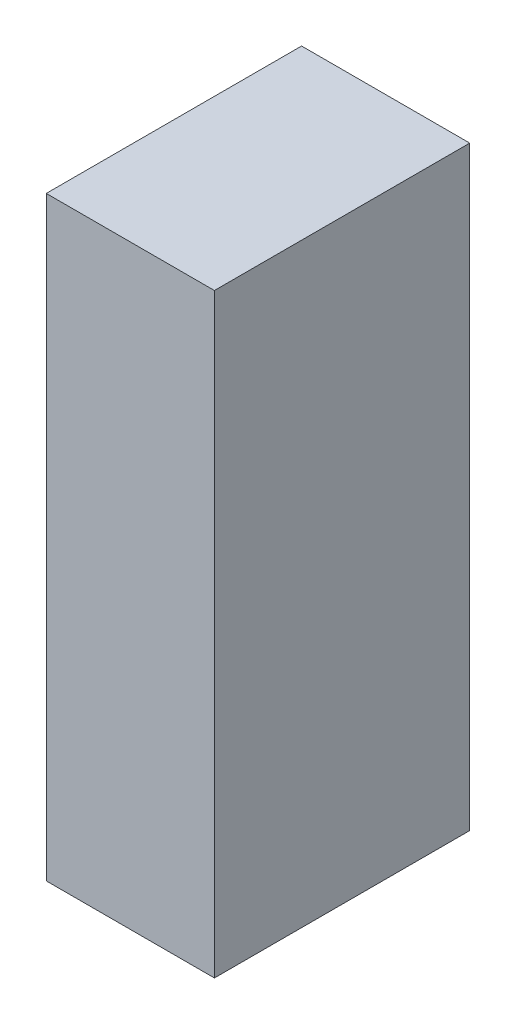
ISO-10303-21;
HEADER;
FILE_DESCRIPTION(('STEP AP214'),'2;1');
FILE_NAME('part.step','',(''),(''),'','','');
FILE_SCHEMA(('AUTOMOTIVE_DESIGN { 1 0 10303 214 1 1 1 1 }'));
ENDSEC;
DATA;
#1=APPLICATION_CONTEXT('core data for automotive mechanical design processes');
#2=APPLICATION_PROTOCOL_DEFINITION('international standard','automotive_design',2000,#1);
#3=PRODUCT_CONTEXT('',#1,'mechanical');
#4=PRODUCT('Part','Part','',(#3));
#5=PRODUCT_RELATED_PRODUCT_CATEGORY('part','',(#4));
#6=PRODUCT_DEFINITION_FORMATION('','',#4);
#7=PRODUCT_DEFINITION_CONTEXT('part definition',#1,'design');
#8=PRODUCT_DEFINITION('design','',#6,#7);
#9=PRODUCT_DEFINITION_SHAPE('','',#8);
#10=(LENGTH_UNIT() NAMED_UNIT(*) SI_UNIT(.MILLI.,.METRE.));
#11=(NAMED_UNIT(*) PLANE_ANGLE_UNIT() SI_UNIT($,.RADIAN.));
#12=(NAMED_UNIT(*) SI_UNIT($,.STERADIAN.) SOLID_ANGLE_UNIT());
#13=UNCERTAINTY_MEASURE_WITH_UNIT(LENGTH_MEASURE(1.E-05),#10,'distance_accuracy_value','');
#14=(GEOMETRIC_REPRESENTATION_CONTEXT(3) GLOBAL_UNCERTAINTY_ASSIGNED_CONTEXT((#13)) GLOBAL_UNIT_ASSIGNED_CONTEXT((#10,
#11,#12)) REPRESENTATION_CONTEXT('',''));
#15=CARTESIAN_POINT('',(0.,0.,0.));
#16=DIRECTION('',(0.,0.,1.));
#17=DIRECTION('',(1.,0.,0.));
#18=AXIS2_PLACEMENT_3D('',#15,#16,#17);
#19=CARTESIAN_POINT('',(-0.24699214,-0.87449152,0.));
#20=DIRECTION('',(-0.999999999998946,1.45227462341292E-06,0.));
#21=DIRECTION('',(1.45227462341292E-06,0.999999999998946,0.));
#22=AXIS2_PLACEMENT_3D('',#19,#20,#21);
#23=PLANE('',#22);
#24=DIRECTION('',(0.,0.,1.));
#25=VECTOR('',#24,1.);
#26=CARTESIAN_POINT('',(-0.24699214,-0.87449152,0.));
#27=LINE('',#26,#25);
#28=CARTESIAN_POINT('',(-0.24699214,-0.87449152,0.));
#29=VERTEX_POINT('',#28);
#30=CARTESIAN_POINT('',(-0.24699214,-0.87449152,0.75000104));
#31=VERTEX_POINT('',#30);
#32=EDGE_CURVE('E11',#29,#31,#27,.T.);
#33=ORIENTED_EDGE('',*,*,#32,.T.);
#34=DIRECTION('',(1.45227462341292E-06,0.999999999998946,0.));
#35=VECTOR('',#34,1.);
#36=CARTESIAN_POINT('',(-0.24699214,-0.87449152,0.75000104));
#37=LINE('',#36,#35);
#38=CARTESIAN_POINT('',(-0.2469896,0.87448898,0.75000104));
#39=VERTEX_POINT('',#38);
#40=EDGE_CURVE('E23',#31,#39,#37,.T.);
#41=ORIENTED_EDGE('',*,*,#40,.T.);
#42=DIRECTION('',(0.,0.,1.));
#43=VECTOR('',#42,1.);
#44=CARTESIAN_POINT('',(-0.2469896,0.87448898,0.));
#45=LINE('',#44,#43);
#46=CARTESIAN_POINT('',(-0.2469896,0.87448898,0.));
#47=VERTEX_POINT('',#46);
#48=EDGE_CURVE('E84',#47,#39,#45,.T.);
#49=ORIENTED_EDGE('',*,*,#48,.F.);
#50=DIRECTION('',(1.45227462341292E-06,0.999999999998946,0.));
#51=VECTOR('',#50,1.);
#52=CARTESIAN_POINT('',(-0.24699214,-0.87449152,0.));
#53=LINE('',#52,#51);
#54=EDGE_CURVE('E82',#29,#47,#53,.T.);
#55=ORIENTED_EDGE('',*,*,#54,.F.);
#56=EDGE_LOOP('',(#33,#41,#49,#55));
#57=FACE_BOUND('',#56,.T.);
#58=ADVANCED_FACE('F16',(#57),#23,.T.);
#59=CARTESIAN_POINT('',(-0.2469896,0.87448898,0.));
#60=DIRECTION('',(-5.14189046130287E-06,0.999999999986781,0.));
#61=DIRECTION('',(0.999999999986781,5.14189046130287E-06,0.));
#62=AXIS2_PLACEMENT_3D('',#59,#60,#61);
#63=PLANE('',#62);
#64=ORIENTED_EDGE('',*,*,#48,.T.);
#65=DIRECTION('',(0.999999999986781,5.14189046130287E-06,0.));
#66=VECTOR('',#65,1.);
#67=CARTESIAN_POINT('',(-0.2469896,0.87448898,0.75000104));
#68=LINE('',#67,#66);
#69=CARTESIAN_POINT('',(0.24699214,0.87449152,0.75000104));
#70=VERTEX_POINT('',#69);
#71=EDGE_CURVE('E80',#39,#70,#68,.T.);
#72=ORIENTED_EDGE('',*,*,#71,.T.);
#73=DIRECTION('',(0.,0.,1.));
#74=VECTOR('',#73,1.);
#75=CARTESIAN_POINT('',(0.24699214,0.87449152,0.));
#76=LINE('',#75,#74);
#77=CARTESIAN_POINT('',(0.24699214,0.87449152,0.));
#78=VERTEX_POINT('',#77);
#79=EDGE_CURVE('E78',#78,#70,#76,.T.);
#80=ORIENTED_EDGE('',*,*,#79,.F.);
#81=DIRECTION('',(0.999999999986781,5.14189046130287E-06,0.));
#82=VECTOR('',#81,1.);
#83=CARTESIAN_POINT('',(-0.2469896,0.87448898,0.));
#84=LINE('',#83,#82);
#85=EDGE_CURVE('E69',#47,#78,#84,.T.);
#86=ORIENTED_EDGE('',*,*,#85,.F.);
#87=EDGE_LOOP('',(#64,#72,#80,#86));
#88=FACE_BOUND('',#87,.T.);
#89=ADVANCED_FACE('F89',(#88),#63,.T.);
#90=CARTESIAN_POINT('',(0.24699214,0.87449152,0.));
#91=DIRECTION('',(1.,0.,0.));
#92=DIRECTION('',(0.,-1.,0.));
#93=AXIS2_PLACEMENT_3D('',#90,#91,#92);
#94=PLANE('',#93);
#95=ORIENTED_EDGE('',*,*,#79,.T.);
#96=DIRECTION('',(0.,-1.,0.));
#97=VECTOR('',#96,1.);
#98=CARTESIAN_POINT('',(0.24699214,0.87449152,0.75000104));
#99=LINE('',#98,#97);
#100=CARTESIAN_POINT('',(0.24699214,-0.87449152,0.75000104));
#101=VERTEX_POINT('',#100);
#102=EDGE_CURVE('E59',#70,#101,#99,.T.);
#103=ORIENTED_EDGE('',*,*,#102,.T.);
#104=DIRECTION('',(0.,0.,1.));
#105=VECTOR('',#104,1.);
#106=CARTESIAN_POINT('',(0.24699214,-0.87449152,0.));
#107=LINE('',#106,#105);
#108=CARTESIAN_POINT('',(0.24699214,-0.87449152,0.));
#109=VERTEX_POINT('',#108);
#110=EDGE_CURVE('E53',#109,#101,#107,.T.);
#111=ORIENTED_EDGE('',*,*,#110,.F.);
#112=DIRECTION('',(0.,-1.,0.));
#113=VECTOR('',#112,1.);
#114=CARTESIAN_POINT('',(0.24699214,0.87449152,0.));
#115=LINE('',#114,#113);
#116=EDGE_CURVE('E57',#78,#109,#115,.T.);
#117=ORIENTED_EDGE('',*,*,#116,.F.);
#118=EDGE_LOOP('',(#95,#103,#111,#117));
#119=FACE_BOUND('',#118,.T.);
#120=ADVANCED_FACE('F56',(#119),#94,.T.);
#121=CARTESIAN_POINT('',(0.24699214,-0.87449152,0.));
#122=DIRECTION('',(0.,-1.,0.));
#123=DIRECTION('',(-1.,0.,0.));
#124=AXIS2_PLACEMENT_3D('',#121,#122,#123);
#125=PLANE('',#124);
#126=ORIENTED_EDGE('',*,*,#110,.T.);
#127=DIRECTION('',(-1.,0.,0.));
#128=VECTOR('',#127,1.);
#129=CARTESIAN_POINT('',(0.24699214,-0.87449152,0.75000104));
#130=LINE('',#129,#128);
#131=EDGE_CURVE('E70',#101,#31,#130,.T.);
#132=ORIENTED_EDGE('',*,*,#131,.T.);
#133=ORIENTED_EDGE('',*,*,#32,.F.);
#134=DIRECTION('',(-1.,0.,0.));
#135=VECTOR('',#134,1.);
#136=CARTESIAN_POINT('',(0.24699214,-0.87449152,0.));
#137=LINE('',#136,#135);
#138=EDGE_CURVE('E67',#109,#29,#137,.T.);
#139=ORIENTED_EDGE('',*,*,#138,.F.);
#140=EDGE_LOOP('',(#126,#132,#133,#139));
#141=FACE_BOUND('',#140,.T.);
#142=ADVANCED_FACE('F72',(#141),#125,.T.);
#143=CARTESIAN_POINT('',(-0.24699214,-0.87449152,0.));
#144=DIRECTION('',(0.,0.,1.));
#145=DIRECTION('',(1.,0.,0.));
#146=AXIS2_PLACEMENT_3D('',#143,#144,#145);
#147=PLANE('',#146);
#148=ORIENTED_EDGE('',*,*,#54,.T.);
#149=ORIENTED_EDGE('',*,*,#85,.T.);
#150=ORIENTED_EDGE('',*,*,#116,.T.);
#151=ORIENTED_EDGE('',*,*,#138,.T.);
#152=EDGE_LOOP('',(#148,#149,#150,#151));
#153=FACE_BOUND('',#152,.T.);
#154=ADVANCED_FACE('F66',(#153),#147,.F.);
#155=CARTESIAN_POINT('',(-0.24699214,-0.87449152,0.75000104));
#156=DIRECTION('',(0.,0.,1.));
#157=DIRECTION('',(1.,0.,0.));
#158=AXIS2_PLACEMENT_3D('',#155,#156,#157);
#159=PLANE('',#158);
#160=ORIENTED_EDGE('',*,*,#131,.F.);
#161=ORIENTED_EDGE('',*,*,#102,.F.);
#162=ORIENTED_EDGE('',*,*,#71,.F.);
#163=ORIENTED_EDGE('',*,*,#40,.F.);
#164=EDGE_LOOP('',(#160,#161,#162,#163));
#165=FACE_BOUND('',#164,.T.);
#166=ADVANCED_FACE('F90',(#165),#159,.T.);
#167=CLOSED_SHELL('',(#58,#89,#120,#142,#154,#166));
#168=MANIFOLD_SOLID_BREP('B1',#167);
#169=ADVANCED_BREP_SHAPE_REPRESENTATION('',(#18,#168),#14);
#170=SHAPE_DEFINITION_REPRESENTATION(#9,#169);
ENDSEC;
END-ISO-10303-21;
